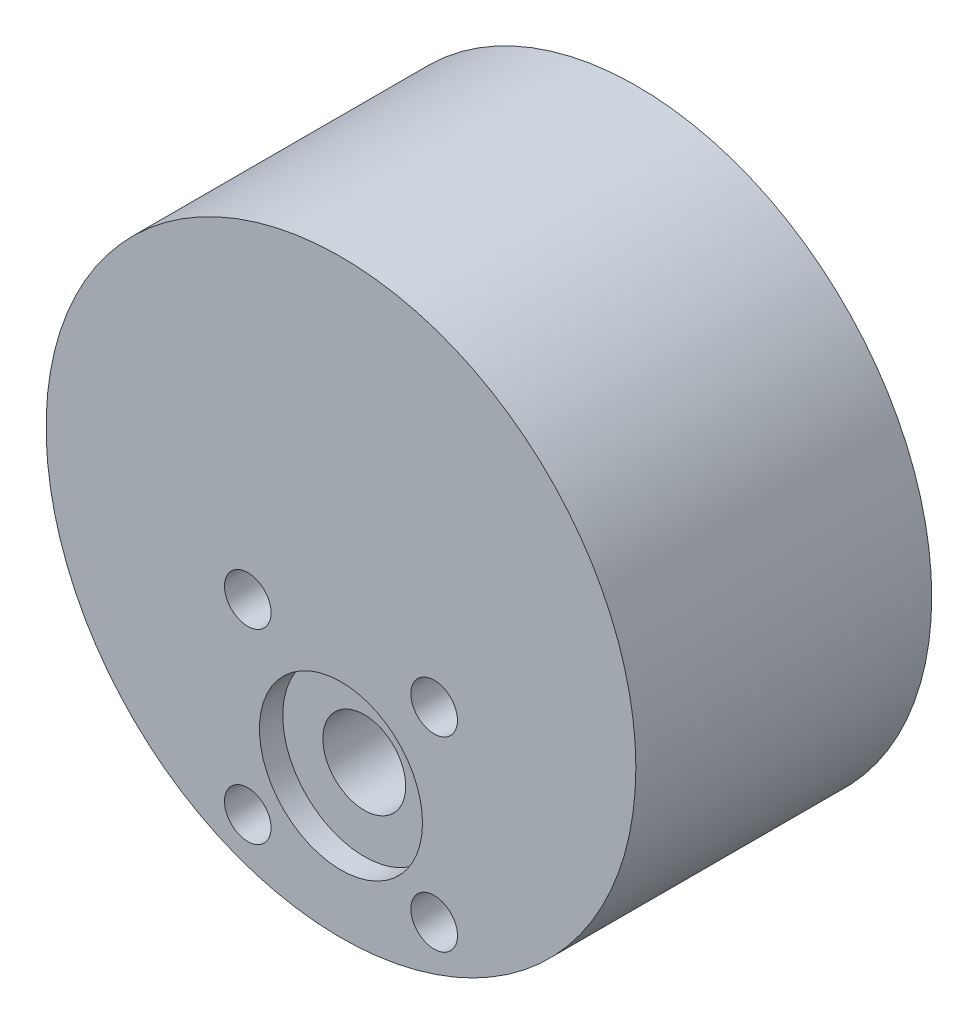
ISO-10303-21;
HEADER;
FILE_DESCRIPTION(('STEP AP214'),'2;1');
FILE_NAME('part.step','',(''),(''),'','','');
FILE_SCHEMA(('AUTOMOTIVE_DESIGN { 1 0 10303 214 1 1 1 1 }'));
ENDSEC;
DATA;
#1=APPLICATION_CONTEXT('core data for automotive mechanical design processes');
#2=APPLICATION_PROTOCOL_DEFINITION('international standard','automotive_design',2000,#1);
#3=PRODUCT_CONTEXT('',#1,'mechanical');
#4=PRODUCT('Part','Part','',(#3));
#5=PRODUCT_RELATED_PRODUCT_CATEGORY('part','',(#4));
#6=PRODUCT_DEFINITION_FORMATION('','',#4);
#7=PRODUCT_DEFINITION_CONTEXT('part definition',#1,'design');
#8=PRODUCT_DEFINITION('design','',#6,#7);
#9=PRODUCT_DEFINITION_SHAPE('','',#8);
#10=(LENGTH_UNIT() NAMED_UNIT(*) SI_UNIT(.MILLI.,.METRE.));
#11=(NAMED_UNIT(*) PLANE_ANGLE_UNIT() SI_UNIT($,.RADIAN.));
#12=(NAMED_UNIT(*) SI_UNIT($,.STERADIAN.) SOLID_ANGLE_UNIT());
#13=UNCERTAINTY_MEASURE_WITH_UNIT(LENGTH_MEASURE(1.E-05),#10,'distance_accuracy_value','');
#14=(GEOMETRIC_REPRESENTATION_CONTEXT(3) GLOBAL_UNCERTAINTY_ASSIGNED_CONTEXT((#13)) GLOBAL_UNIT_ASSIGNED_CONTEXT((#10,
#11,#12)) REPRESENTATION_CONTEXT('',''));
#15=CARTESIAN_POINT('',(0.,0.,0.));
#16=DIRECTION('',(0.,0.,1.));
#17=DIRECTION('',(1.,0.,0.));
#18=AXIS2_PLACEMENT_3D('',#15,#16,#17);
#19=CARTESIAN_POINT('',(0.,-13.2787880330214,0.));
#20=DIRECTION('',(0.,0.,1.));
#21=DIRECTION('',(1.,0.,0.));
#22=AXIS2_PLACEMENT_3D('',#19,#20,#21);
#23=CYLINDRICAL_SURFACE('',#22,3.556);
#24=CARTESIAN_POINT('',(0.,-13.2787880330214,0.));
#25=DIRECTION('',(0.,0.,1.));
#26=DIRECTION('',(1.,0.,0.));
#27=AXIS2_PLACEMENT_3D('',#24,#25,#26);
#28=CIRCLE('',#27,3.556);
#29=CARTESIAN_POINT('',(3.556,-13.2787880330214,0.));
#30=VERTEX_POINT('',#29);
#31=EDGE_CURVE('E53',#30,#30,#28,.T.);
#32=ORIENTED_EDGE('',*,*,#31,.F.);
#33=EDGE_LOOP('',(#32));
#34=FACE_BOUND('',#33,.T.);
#35=CARTESIAN_POINT('',(0.,-13.2787880330214,23.4));
#36=DIRECTION('',(0.,0.,1.));
#37=DIRECTION('',(1.,0.,0.));
#38=AXIS2_PLACEMENT_3D('',#35,#36,#37);
#39=CIRCLE('',#38,3.556);
#40=CARTESIAN_POINT('',(3.556,-13.2787880330214,23.4));
#41=VERTEX_POINT('',#40);
#42=EDGE_CURVE('E63',#41,#41,#39,.F.);
#43=ORIENTED_EDGE('',*,*,#42,.F.);
#44=EDGE_LOOP('',(#43));
#45=FACE_BOUND('',#44,.T.);
#46=ADVANCED_FACE('F40',(#34,#45),#23,.F.);
#47=CARTESIAN_POINT('',(0.,0.,25.4));
#48=DIRECTION('',(0.,0.,-1.));
#49=DIRECTION('',(-1.,0.,0.));
#50=AXIS2_PLACEMENT_3D('',#47,#48,#49);
#51=CYLINDRICAL_SURFACE('',#50,25.3146461706934);
#52=CARTESIAN_POINT('',(0.,0.,25.4));
#53=DIRECTION('',(0.,0.,1.));
#54=DIRECTION('',(1.,0.,0.));
#55=AXIS2_PLACEMENT_3D('',#52,#53,#54);
#56=CIRCLE('',#55,25.3146461706934);
#57=CARTESIAN_POINT('',(25.3146461706934,0.,25.4));
#58=VERTEX_POINT('',#57);
#59=EDGE_CURVE('E10',#58,#58,#56,.T.);
#60=ORIENTED_EDGE('',*,*,#59,.F.);
#61=EDGE_LOOP('',(#60));
#62=FACE_BOUND('',#61,.T.);
#63=CARTESIAN_POINT('',(0.,0.,0.));
#64=DIRECTION('',(0.,0.,1.));
#65=DIRECTION('',(1.,0.,0.));
#66=AXIS2_PLACEMENT_3D('',#63,#64,#65);
#67=CIRCLE('',#66,25.3146461706934);
#68=CARTESIAN_POINT('',(25.3146461706934,0.,0.));
#69=VERTEX_POINT('',#68);
#70=EDGE_CURVE('E44',#69,#69,#67,.T.);
#71=ORIENTED_EDGE('',*,*,#70,.T.);
#72=EDGE_LOOP('',(#71));
#73=FACE_BOUND('',#72,.T.);
#74=ADVANCED_FACE('F42',(#62,#73),#51,.T.);
#75=CARTESIAN_POINT('',(0.,0.,25.4));
#76=DIRECTION('',(0.,0.,1.));
#77=DIRECTION('',(1.,0.,0.));
#78=AXIS2_PLACEMENT_3D('',#75,#76,#77);
#79=PLANE('',#78);
#80=CARTESIAN_POINT('',(-8.,-4.15816014651442,25.4));
#81=DIRECTION('',(0.,0.,1.));
#82=DIRECTION('',(1.,0.,0.));
#83=AXIS2_PLACEMENT_3D('',#80,#81,#82);
#84=CIRCLE('',#83,2.);
#85=CARTESIAN_POINT('',(-6.,-4.15816014651442,25.4));
#86=VERTEX_POINT('',#85);
#87=EDGE_CURVE('E83',#86,#86,#84,.T.);
#88=ORIENTED_EDGE('',*,*,#87,.F.);
#89=EDGE_LOOP('',(#88));
#90=FACE_BOUND('',#89,.T.);
#91=CARTESIAN_POINT('',(8.,-4.15816014651443,25.4));
#92=DIRECTION('',(0.,0.,1.));
#93=DIRECTION('',(1.,0.,0.));
#94=AXIS2_PLACEMENT_3D('',#91,#92,#93);
#95=CIRCLE('',#94,2.);
#96=CARTESIAN_POINT('',(10.,-4.15816014651443,25.4));
#97=VERTEX_POINT('',#96);
#98=EDGE_CURVE('E91',#97,#97,#95,.T.);
#99=ORIENTED_EDGE('',*,*,#98,.F.);
#100=EDGE_LOOP('',(#99));
#101=FACE_BOUND('',#100,.T.);
#102=CARTESIAN_POINT('',(8.,-20.1581601465144,25.4));
#103=DIRECTION('',(0.,0.,1.));
#104=DIRECTION('',(1.,0.,0.));
#105=AXIS2_PLACEMENT_3D('',#102,#103,#104);
#106=CIRCLE('',#105,2.);
#107=CARTESIAN_POINT('',(10.,-20.1581601465144,25.4));
#108=VERTEX_POINT('',#107);
#109=EDGE_CURVE('E75',#108,#108,#106,.T.);
#110=ORIENTED_EDGE('',*,*,#109,.F.);
#111=EDGE_LOOP('',(#110));
#112=FACE_BOUND('',#111,.T.);
#113=CARTESIAN_POINT('',(-8.,-20.1581601465144,25.4));
#114=DIRECTION('',(0.,0.,1.));
#115=DIRECTION('',(1.,0.,0.));
#116=AXIS2_PLACEMENT_3D('',#113,#114,#115);
#117=CIRCLE('',#116,2.);
#118=CARTESIAN_POINT('',(-6.,-20.1581601465144,25.4));
#119=VERTEX_POINT('',#118);
#120=EDGE_CURVE('E71',#119,#119,#117,.T.);
#121=ORIENTED_EDGE('',*,*,#120,.F.);
#122=EDGE_LOOP('',(#121));
#123=FACE_BOUND('',#122,.T.);
#124=CARTESIAN_POINT('',(0.,-13.2787880330214,25.4));
#125=DIRECTION('',(0.,0.,1.));
#126=DIRECTION('',(1.,0.,0.));
#127=AXIS2_PLACEMENT_3D('',#124,#125,#126);
#128=CIRCLE('',#127,7.);
#129=CARTESIAN_POINT('',(7.,-13.2787880330214,25.4));
#130=VERTEX_POINT('',#129);
#131=EDGE_CURVE('E59',#130,#130,#128,.T.);
#132=ORIENTED_EDGE('',*,*,#131,.F.);
#133=EDGE_LOOP('',(#132));
#134=FACE_BOUND('',#133,.T.);
#135=ORIENTED_EDGE('',*,*,#59,.T.);
#136=EDGE_LOOP('',(#135));
#137=FACE_BOUND('',#136,.T.);
#138=ADVANCED_FACE('F105',(#90,#101,#112,#123,#134,#137),#79,.T.);
#139=CARTESIAN_POINT('',(0.,0.,0.));
#140=DIRECTION('',(0.,0.,1.));
#141=DIRECTION('',(1.,0.,0.));
#142=AXIS2_PLACEMENT_3D('',#139,#140,#141);
#143=PLANE('',#142);
#144=CARTESIAN_POINT('',(-8.,-4.15816014651442,0.));
#145=DIRECTION('',(0.,0.,1.));
#146=DIRECTION('',(1.,0.,0.));
#147=AXIS2_PLACEMENT_3D('',#144,#145,#146);
#148=CIRCLE('',#147,2.);
#149=CARTESIAN_POINT('',(-6.,-4.15816014651442,0.));
#150=VERTEX_POINT('',#149);
#151=EDGE_CURVE('E79',#150,#150,#148,.T.);
#152=ORIENTED_EDGE('',*,*,#151,.T.);
#153=EDGE_LOOP('',(#152));
#154=FACE_BOUND('',#153,.T.);
#155=CARTESIAN_POINT('',(8.,-4.15816014651443,0.));
#156=DIRECTION('',(0.,0.,1.));
#157=DIRECTION('',(1.,0.,0.));
#158=AXIS2_PLACEMENT_3D('',#155,#156,#157);
#159=CIRCLE('',#158,2.);
#160=CARTESIAN_POINT('',(10.,-4.15816014651443,0.));
#161=VERTEX_POINT('',#160);
#162=EDGE_CURVE('E87',#161,#161,#159,.T.);
#163=ORIENTED_EDGE('',*,*,#162,.T.);
#164=EDGE_LOOP('',(#163));
#165=FACE_BOUND('',#164,.T.);
#166=CARTESIAN_POINT('',(8.,-20.1581601465144,0.));
#167=DIRECTION('',(0.,0.,1.));
#168=DIRECTION('',(1.,0.,0.));
#169=AXIS2_PLACEMENT_3D('',#166,#167,#168);
#170=CIRCLE('',#169,2.);
#171=CARTESIAN_POINT('',(10.,-20.1581601465144,0.));
#172=VERTEX_POINT('',#171);
#173=EDGE_CURVE('E95',#172,#172,#170,.T.);
#174=ORIENTED_EDGE('',*,*,#173,.T.);
#175=EDGE_LOOP('',(#174));
#176=FACE_BOUND('',#175,.T.);
#177=CARTESIAN_POINT('',(-8.,-20.1581601465144,0.));
#178=DIRECTION('',(0.,0.,1.));
#179=DIRECTION('',(1.,0.,0.));
#180=AXIS2_PLACEMENT_3D('',#177,#178,#179);
#181=CIRCLE('',#180,2.);
#182=CARTESIAN_POINT('',(-6.,-20.1581601465144,0.));
#183=VERTEX_POINT('',#182);
#184=EDGE_CURVE('E64',#183,#183,#181,.T.);
#185=ORIENTED_EDGE('',*,*,#184,.T.);
#186=EDGE_LOOP('',(#185));
#187=FACE_BOUND('',#186,.T.);
#188=ORIENTED_EDGE('',*,*,#31,.T.);
#189=EDGE_LOOP('',(#188));
#190=FACE_BOUND('',#189,.T.);
#191=ORIENTED_EDGE('',*,*,#70,.F.);
#192=EDGE_LOOP('',(#191));
#193=FACE_BOUND('',#192,.T.);
#194=ADVANCED_FACE('F108',(#154,#165,#176,#187,#190,#193),#143,.F.);
#195=CARTESIAN_POINT('',(0.,-13.2787880330214,23.4));
#196=DIRECTION('',(0.,0.,1.));
#197=DIRECTION('',(1.,0.,0.));
#198=AXIS2_PLACEMENT_3D('',#195,#196,#197);
#199=CYLINDRICAL_SURFACE('',#198,7.);
#200=CARTESIAN_POINT('',(0.,-13.2787880330214,23.4));
#201=DIRECTION('',(0.,0.,1.));
#202=DIRECTION('',(1.,0.,0.));
#203=AXIS2_PLACEMENT_3D('',#200,#201,#202);
#204=CIRCLE('',#203,7.);
#205=CARTESIAN_POINT('',(7.,-13.2787880330214,23.4));
#206=VERTEX_POINT('',#205);
#207=EDGE_CURVE('E58',#206,#206,#204,.T.);
#208=ORIENTED_EDGE('',*,*,#207,.F.);
#209=EDGE_LOOP('',(#208));
#210=FACE_BOUND('',#209,.T.);
#211=ORIENTED_EDGE('',*,*,#131,.T.);
#212=EDGE_LOOP('',(#211));
#213=FACE_BOUND('',#212,.T.);
#214=ADVANCED_FACE('F115',(#210,#213),#199,.F.);
#215=CARTESIAN_POINT('',(0.,0.,23.4));
#216=DIRECTION('',(0.,0.,1.));
#217=DIRECTION('',(1.,0.,0.));
#218=AXIS2_PLACEMENT_3D('',#215,#216,#217);
#219=PLANE('',#218);
#220=ORIENTED_EDGE('',*,*,#42,.T.);
#221=EDGE_LOOP('',(#220));
#222=FACE_BOUND('',#221,.T.);
#223=ORIENTED_EDGE('',*,*,#207,.T.);
#224=EDGE_LOOP('',(#223));
#225=FACE_BOUND('',#224,.T.);
#226=ADVANCED_FACE('F117',(#222,#225),#219,.T.);
#227=CARTESIAN_POINT('',(-8.,-20.1581601465144,0.));
#228=DIRECTION('',(0.,0.,1.));
#229=DIRECTION('',(1.,0.,0.));
#230=AXIS2_PLACEMENT_3D('',#227,#228,#229);
#231=CYLINDRICAL_SURFACE('',#230,2.);
#232=ORIENTED_EDGE('',*,*,#184,.F.);
#233=EDGE_LOOP('',(#232));
#234=FACE_BOUND('',#233,.T.);
#235=ORIENTED_EDGE('',*,*,#120,.T.);
#236=EDGE_LOOP('',(#235));
#237=FACE_BOUND('',#236,.T.);
#238=ADVANCED_FACE('F124',(#234,#237),#231,.F.);
#239=CARTESIAN_POINT('',(8.,-20.1581601465144,0.));
#240=DIRECTION('',(0.,0.,1.));
#241=DIRECTION('',(1.,0.,0.));
#242=AXIS2_PLACEMENT_3D('',#239,#240,#241);
#243=CYLINDRICAL_SURFACE('',#242,2.);
#244=ORIENTED_EDGE('',*,*,#173,.F.);
#245=EDGE_LOOP('',(#244));
#246=FACE_BOUND('',#245,.T.);
#247=ORIENTED_EDGE('',*,*,#109,.T.);
#248=EDGE_LOOP('',(#247));
#249=FACE_BOUND('',#248,.T.);
#250=ADVANCED_FACE('F103',(#246,#249),#243,.F.);
#251=CARTESIAN_POINT('',(8.,-4.15816014651443,0.));
#252=DIRECTION('',(0.,0.,1.));
#253=DIRECTION('',(1.,0.,0.));
#254=AXIS2_PLACEMENT_3D('',#251,#252,#253);
#255=CYLINDRICAL_SURFACE('',#254,2.);
#256=ORIENTED_EDGE('',*,*,#162,.F.);
#257=EDGE_LOOP('',(#256));
#258=FACE_BOUND('',#257,.T.);
#259=ORIENTED_EDGE('',*,*,#98,.T.);
#260=EDGE_LOOP('',(#259));
#261=FACE_BOUND('',#260,.T.);
#262=ADVANCED_FACE('F177',(#258,#261),#255,.F.);
#263=CARTESIAN_POINT('',(-8.,-4.15816014651442,0.));
#264=DIRECTION('',(0.,0.,1.));
#265=DIRECTION('',(1.,0.,0.));
#266=AXIS2_PLACEMENT_3D('',#263,#264,#265);
#267=CYLINDRICAL_SURFACE('',#266,2.);
#268=ORIENTED_EDGE('',*,*,#151,.F.);
#269=EDGE_LOOP('',(#268));
#270=FACE_BOUND('',#269,.T.);
#271=ORIENTED_EDGE('',*,*,#87,.T.);
#272=EDGE_LOOP('',(#271));
#273=FACE_BOUND('',#272,.T.);
#274=ADVANCED_FACE('F188',(#270,#273),#267,.F.);
#275=CLOSED_SHELL('',(#46,#74,#138,#194,#214,#226,#238,#250,#262,#274));
#276=MANIFOLD_SOLID_BREP('B2',#275);
#277=ADVANCED_BREP_SHAPE_REPRESENTATION('',(#18,#276),#14);
#278=SHAPE_DEFINITION_REPRESENTATION(#9,#277);
ENDSEC;
END-ISO-10303-21;
